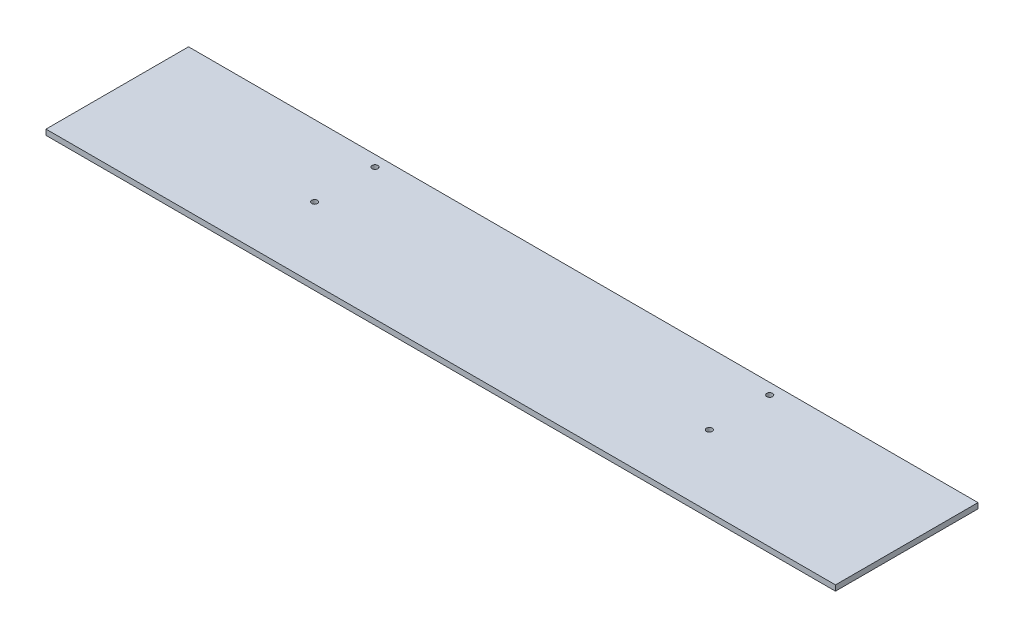
ISO-10303-21;
HEADER;
FILE_DESCRIPTION(('STEP AP214'),'2;1');
FILE_NAME('part.step','',(''),(''),'','','');
FILE_SCHEMA(('AUTOMOTIVE_DESIGN { 1 0 10303 214 1 1 1 1 }'));
ENDSEC;
DATA;
#1=APPLICATION_CONTEXT('core data for automotive mechanical design processes');
#2=APPLICATION_PROTOCOL_DEFINITION('international standard','automotive_design',2000,#1);
#3=PRODUCT_CONTEXT('',#1,'mechanical');
#4=PRODUCT('Part','Part','',(#3));
#5=PRODUCT_RELATED_PRODUCT_CATEGORY('part','',(#4));
#6=PRODUCT_DEFINITION_FORMATION('','',#4);
#7=PRODUCT_DEFINITION_CONTEXT('part definition',#1,'design');
#8=PRODUCT_DEFINITION('design','',#6,#7);
#9=PRODUCT_DEFINITION_SHAPE('','',#8);
#10=(LENGTH_UNIT() NAMED_UNIT(*) SI_UNIT(.MILLI.,.METRE.));
#11=(NAMED_UNIT(*) PLANE_ANGLE_UNIT() SI_UNIT($,.RADIAN.));
#12=(NAMED_UNIT(*) SI_UNIT($,.STERADIAN.) SOLID_ANGLE_UNIT());
#13=UNCERTAINTY_MEASURE_WITH_UNIT(LENGTH_MEASURE(1.E-05),#10,'distance_accuracy_value','');
#14=(GEOMETRIC_REPRESENTATION_CONTEXT(3) GLOBAL_UNCERTAINTY_ASSIGNED_CONTEXT((#13)) GLOBAL_UNIT_ASSIGNED_CONTEXT((#10,
#11,#12)) REPRESENTATION_CONTEXT('',''));
#15=CARTESIAN_POINT('',(0.,0.,0.));
#16=DIRECTION('',(0.,0.,1.));
#17=DIRECTION('',(1.,0.,0.));
#18=AXIS2_PLACEMENT_3D('',#15,#16,#17);
#19=CARTESIAN_POINT('',(457.2,-6.35,-665.126898193359));
#20=DIRECTION('',(0.,0.,1.));
#21=DIRECTION('',(1.,0.,0.));
#22=AXIS2_PLACEMENT_3D('',#19,#20,#21);
#23=PLANE('',#22);
#24=DIRECTION('',(1.,0.,0.));
#25=VECTOR('',#24,1.);
#26=CARTESIAN_POINT('',(457.2,0.,-665.126898193359));
#27=LINE('',#26,#25);
#28=CARTESIAN_POINT('',(0.,0.,-665.126898193359));
#29=VERTEX_POINT('',#28);
#30=CARTESIAN_POINT('',(914.4,0.,-665.126898193359));
#31=VERTEX_POINT('',#30);
#32=EDGE_CURVE('E102',#29,#31,#27,.T.);
#33=ORIENTED_EDGE('',*,*,#32,.F.);
#34=DIRECTION('',(0.,1.,0.));
#35=VECTOR('',#34,1.);
#36=CARTESIAN_POINT('',(0.,-6.35,-665.126898193359));
#37=LINE('',#36,#35);
#38=CARTESIAN_POINT('',(0.,-6.35,-665.126898193359));
#39=VERTEX_POINT('',#38);
#40=EDGE_CURVE('E9',#39,#29,#37,.T.);
#41=ORIENTED_EDGE('',*,*,#40,.F.);
#42=DIRECTION('',(1.,0.,0.));
#43=VECTOR('',#42,1.);
#44=CARTESIAN_POINT('',(457.2,-6.35,-665.126898193359));
#45=LINE('',#44,#43);
#46=CARTESIAN_POINT('',(914.4,-6.35,-665.126898193359));
#47=VERTEX_POINT('',#46);
#48=EDGE_CURVE('E79',#39,#47,#45,.T.);
#49=ORIENTED_EDGE('',*,*,#48,.T.);
#50=DIRECTION('',(0.,1.,0.));
#51=VECTOR('',#50,1.);
#52=CARTESIAN_POINT('',(914.4,-6.35,-665.126898193359));
#53=LINE('',#52,#51);
#54=EDGE_CURVE('E38',#47,#31,#53,.T.);
#55=ORIENTED_EDGE('',*,*,#54,.T.);
#56=EDGE_LOOP('',(#33,#41,#49,#55));
#57=FACE_BOUND('',#56,.T.);
#58=ADVANCED_FACE('F14',(#57),#23,.T.);
#59=CARTESIAN_POINT('',(0.,-6.35,-747.676898193359));
#60=DIRECTION('',(1.,0.,0.));
#61=DIRECTION('',(0.,0.,-1.));
#62=AXIS2_PLACEMENT_3D('',#59,#60,#61);
#63=PLANE('',#62);
#64=DIRECTION('',(0.,0.,-1.));
#65=VECTOR('',#64,1.);
#66=CARTESIAN_POINT('',(0.,0.,-747.676898193359));
#67=LINE('',#66,#65);
#68=CARTESIAN_POINT('',(0.,0.,-830.226898193359));
#69=VERTEX_POINT('',#68);
#70=EDGE_CURVE('E86',#29,#69,#67,.T.);
#71=ORIENTED_EDGE('',*,*,#70,.T.);
#72=DIRECTION('',(0.,1.,0.));
#73=VECTOR('',#72,1.);
#74=CARTESIAN_POINT('',(0.,-6.35,-830.226898193359));
#75=LINE('',#74,#73);
#76=CARTESIAN_POINT('',(0.,-6.35,-830.226898193359));
#77=VERTEX_POINT('',#76);
#78=EDGE_CURVE('E24',#77,#69,#75,.T.);
#79=ORIENTED_EDGE('',*,*,#78,.F.);
#80=DIRECTION('',(0.,0.,-1.));
#81=VECTOR('',#80,1.);
#82=CARTESIAN_POINT('',(0.,-6.35,-747.676898193359));
#83=LINE('',#82,#81);
#84=EDGE_CURVE('E73',#39,#77,#83,.T.);
#85=ORIENTED_EDGE('',*,*,#84,.F.);
#86=ORIENTED_EDGE('',*,*,#40,.T.);
#87=EDGE_LOOP('',(#71,#79,#85,#86));
#88=FACE_BOUND('',#87,.T.);
#89=ADVANCED_FACE('F84',(#88),#63,.F.);
#90=CARTESIAN_POINT('',(457.2,-6.35,-830.226898193359));
#91=DIRECTION('',(0.,0.,1.));
#92=DIRECTION('',(1.,0.,0.));
#93=AXIS2_PLACEMENT_3D('',#90,#91,#92);
#94=PLANE('',#93);
#95=DIRECTION('',(1.,0.,0.));
#96=VECTOR('',#95,1.);
#97=CARTESIAN_POINT('',(457.2,0.,-830.226898193359));
#98=LINE('',#97,#96);
#99=CARTESIAN_POINT('',(914.4,0.,-830.226898193359));
#100=VERTEX_POINT('',#99);
#101=EDGE_CURVE('E107',#69,#100,#98,.T.);
#102=ORIENTED_EDGE('',*,*,#101,.T.);
#103=DIRECTION('',(0.,1.,0.));
#104=VECTOR('',#103,1.);
#105=CARTESIAN_POINT('',(914.4,-6.35,-830.226898193359));
#106=LINE('',#105,#104);
#107=CARTESIAN_POINT('',(914.4,-6.35,-830.226898193359));
#108=VERTEX_POINT('',#107);
#109=EDGE_CURVE('E57',#108,#100,#106,.T.);
#110=ORIENTED_EDGE('',*,*,#109,.F.);
#111=DIRECTION('',(1.,0.,0.));
#112=VECTOR('',#111,1.);
#113=CARTESIAN_POINT('',(457.2,-6.35,-830.226898193359));
#114=LINE('',#113,#112);
#115=EDGE_CURVE('E78',#77,#108,#114,.T.);
#116=ORIENTED_EDGE('',*,*,#115,.F.);
#117=ORIENTED_EDGE('',*,*,#78,.T.);
#118=EDGE_LOOP('',(#102,#110,#116,#117));
#119=FACE_BOUND('',#118,.T.);
#120=ADVANCED_FACE('F91',(#119),#94,.F.);
#121=CARTESIAN_POINT('',(914.4,-6.35,-747.676898193359));
#122=DIRECTION('',(1.,0.,0.));
#123=DIRECTION('',(0.,0.,-1.));
#124=AXIS2_PLACEMENT_3D('',#121,#122,#123);
#125=PLANE('',#124);
#126=DIRECTION('',(0.,0.,-1.));
#127=VECTOR('',#126,1.);
#128=CARTESIAN_POINT('',(914.4,0.,-747.676898193359));
#129=LINE('',#128,#127);
#130=EDGE_CURVE('E109',#31,#100,#129,.T.);
#131=ORIENTED_EDGE('',*,*,#130,.F.);
#132=ORIENTED_EDGE('',*,*,#54,.F.);
#133=DIRECTION('',(0.,0.,-1.));
#134=VECTOR('',#133,1.);
#135=CARTESIAN_POINT('',(914.4,-6.35,-747.676898193359));
#136=LINE('',#135,#134);
#137=EDGE_CURVE('E93',#47,#108,#136,.T.);
#138=ORIENTED_EDGE('',*,*,#137,.T.);
#139=ORIENTED_EDGE('',*,*,#109,.T.);
#140=EDGE_LOOP('',(#131,#132,#138,#139));
#141=FACE_BOUND('',#140,.T.);
#142=ADVANCED_FACE('F152',(#141),#125,.T.);
#143=CARTESIAN_POINT('',(457.2,-6.35,-747.676898193359));
#144=DIRECTION('',(0.,-1.,0.));
#145=DIRECTION('',(1.,0.,0.));
#146=AXIS2_PLACEMENT_3D('',#143,#144,#145);
#147=PLANE('',#146);
#148=CARTESIAN_POINT('',(685.8,-6.35,-747.676898193359));
#149=DIRECTION('',(0.,-1.,0.));
#150=DIRECTION('',(0.,0.,-1.));
#151=AXIS2_PLACEMENT_3D('',#148,#149,#150);
#152=CIRCLE('',#151,3.3655);
#153=CARTESIAN_POINT('',(685.8,-6.35,-751.042398193359));
#154=VERTEX_POINT('',#153);
#155=EDGE_CURVE('E145',#154,#154,#152,.T.);
#156=ORIENTED_EDGE('',*,*,#155,.F.);
#157=EDGE_LOOP('',(#156));
#158=FACE_BOUND('',#157,.T.);
#159=CARTESIAN_POINT('',(685.8,-6.35,-817.526898193359));
#160=DIRECTION('',(0.,-1.,0.));
#161=DIRECTION('',(0.,0.,-1.));
#162=AXIS2_PLACEMENT_3D('',#159,#160,#161);
#163=CIRCLE('',#162,3.3655);
#164=CARTESIAN_POINT('',(685.8,-6.35,-820.892398193359));
#165=VERTEX_POINT('',#164);
#166=EDGE_CURVE('E128',#165,#165,#163,.T.);
#167=ORIENTED_EDGE('',*,*,#166,.F.);
#168=EDGE_LOOP('',(#167));
#169=FACE_BOUND('',#168,.T.);
#170=CARTESIAN_POINT('',(228.6,-6.35,-817.526898193359));
#171=DIRECTION('',(0.,-1.,0.));
#172=DIRECTION('',(0.,0.,-1.));
#173=AXIS2_PLACEMENT_3D('',#170,#171,#172);
#174=CIRCLE('',#173,3.3655);
#175=CARTESIAN_POINT('',(228.6,-6.35,-820.892398193359));
#176=VERTEX_POINT('',#175);
#177=EDGE_CURVE('E124',#176,#176,#174,.T.);
#178=ORIENTED_EDGE('',*,*,#177,.F.);
#179=EDGE_LOOP('',(#178));
#180=FACE_BOUND('',#179,.T.);
#181=CARTESIAN_POINT('',(228.6,-6.35,-747.676898193359));
#182=DIRECTION('',(0.,-1.,0.));
#183=DIRECTION('',(0.,0.,-1.));
#184=AXIS2_PLACEMENT_3D('',#181,#182,#183);
#185=CIRCLE('',#184,3.3655);
#186=CARTESIAN_POINT('',(228.6,-6.35,-751.042398193359));
#187=VERTEX_POINT('',#186);
#188=EDGE_CURVE('E120',#187,#187,#185,.T.);
#189=ORIENTED_EDGE('',*,*,#188,.F.);
#190=EDGE_LOOP('',(#189));
#191=FACE_BOUND('',#190,.T.);
#192=ORIENTED_EDGE('',*,*,#48,.F.);
#193=ORIENTED_EDGE('',*,*,#84,.T.);
#194=ORIENTED_EDGE('',*,*,#115,.T.);
#195=ORIENTED_EDGE('',*,*,#137,.F.);
#196=EDGE_LOOP('',(#192,#193,#194,#195));
#197=FACE_BOUND('',#196,.T.);
#198=ADVANCED_FACE('F75',(#158,#169,#180,#191,#197),#147,.T.);
#199=CARTESIAN_POINT('',(457.2,0.,-747.676898193359));
#200=DIRECTION('',(0.,-1.,0.));
#201=DIRECTION('',(1.,0.,0.));
#202=AXIS2_PLACEMENT_3D('',#199,#200,#201);
#203=PLANE('',#202);
#204=CARTESIAN_POINT('',(685.8,0.,-747.676898193359));
#205=DIRECTION('',(0.,-1.,0.));
#206=DIRECTION('',(0.,0.,-1.));
#207=AXIS2_PLACEMENT_3D('',#204,#205,#206);
#208=CIRCLE('',#207,3.3655);
#209=CARTESIAN_POINT('',(685.8,0.,-751.042398193359));
#210=VERTEX_POINT('',#209);
#211=EDGE_CURVE('E17',#210,#210,#208,.F.);
#212=ORIENTED_EDGE('',*,*,#211,.F.);
#213=EDGE_LOOP('',(#212));
#214=FACE_BOUND('',#213,.T.);
#215=CARTESIAN_POINT('',(685.8,0.,-817.526898193359));
#216=DIRECTION('',(0.,-1.,0.));
#217=DIRECTION('',(0.,0.,-1.));
#218=AXIS2_PLACEMENT_3D('',#215,#216,#217);
#219=CIRCLE('',#218,3.3655);
#220=CARTESIAN_POINT('',(685.8,0.,-820.892398193359));
#221=VERTEX_POINT('',#220);
#222=EDGE_CURVE('E125',#221,#221,#219,.F.);
#223=ORIENTED_EDGE('',*,*,#222,.F.);
#224=EDGE_LOOP('',(#223));
#225=FACE_BOUND('',#224,.T.);
#226=CARTESIAN_POINT('',(228.6,0.,-817.526898193359));
#227=DIRECTION('',(0.,-1.,0.));
#228=DIRECTION('',(0.,0.,-1.));
#229=AXIS2_PLACEMENT_3D('',#226,#227,#228);
#230=CIRCLE('',#229,3.3655);
#231=CARTESIAN_POINT('',(228.6,0.,-820.892398193359));
#232=VERTEX_POINT('',#231);
#233=EDGE_CURVE('E121',#232,#232,#230,.F.);
#234=ORIENTED_EDGE('',*,*,#233,.F.);
#235=EDGE_LOOP('',(#234));
#236=FACE_BOUND('',#235,.T.);
#237=CARTESIAN_POINT('',(228.6,0.,-747.676898193359));
#238=DIRECTION('',(0.,-1.,0.));
#239=DIRECTION('',(0.,0.,-1.));
#240=AXIS2_PLACEMENT_3D('',#237,#238,#239);
#241=CIRCLE('',#240,3.3655);
#242=CARTESIAN_POINT('',(228.6,0.,-751.042398193359));
#243=VERTEX_POINT('',#242);
#244=EDGE_CURVE('E105',#243,#243,#241,.F.);
#245=ORIENTED_EDGE('',*,*,#244,.F.);
#246=EDGE_LOOP('',(#245));
#247=FACE_BOUND('',#246,.T.);
#248=ORIENTED_EDGE('',*,*,#32,.T.);
#249=ORIENTED_EDGE('',*,*,#130,.T.);
#250=ORIENTED_EDGE('',*,*,#101,.F.);
#251=ORIENTED_EDGE('',*,*,#70,.F.);
#252=EDGE_LOOP('',(#248,#249,#250,#251));
#253=FACE_BOUND('',#252,.T.);
#254=ADVANCED_FACE('F160',(#214,#225,#236,#247,#253),#203,.F.);
#255=CARTESIAN_POINT('',(228.6,923.868121694976,-747.676898193359));
#256=DIRECTION('',(0.,-1.,0.));
#257=DIRECTION('',(0.,0.,-1.));
#258=AXIS2_PLACEMENT_3D('',#255,#256,#257);
#259=CYLINDRICAL_SURFACE('',#258,3.3655);
#260=ORIENTED_EDGE('',*,*,#188,.T.);
#261=EDGE_LOOP('',(#260));
#262=FACE_BOUND('',#261,.T.);
#263=ORIENTED_EDGE('',*,*,#244,.T.);
#264=EDGE_LOOP('',(#263));
#265=FACE_BOUND('',#264,.T.);
#266=ADVANCED_FACE('F202',(#262,#265),#259,.F.);
#267=CARTESIAN_POINT('',(228.6,923.868121694976,-817.526898193359));
#268=DIRECTION('',(0.,-1.,0.));
#269=DIRECTION('',(0.,0.,-1.));
#270=AXIS2_PLACEMENT_3D('',#267,#268,#269);
#271=CYLINDRICAL_SURFACE('',#270,3.3655);
#272=ORIENTED_EDGE('',*,*,#177,.T.);
#273=EDGE_LOOP('',(#272));
#274=FACE_BOUND('',#273,.T.);
#275=ORIENTED_EDGE('',*,*,#233,.T.);
#276=EDGE_LOOP('',(#275));
#277=FACE_BOUND('',#276,.T.);
#278=ADVANCED_FACE('F212',(#274,#277),#271,.F.);
#279=CARTESIAN_POINT('',(685.8,923.868121694976,-817.526898193359));
#280=DIRECTION('',(0.,-1.,0.));
#281=DIRECTION('',(0.,0.,-1.));
#282=AXIS2_PLACEMENT_3D('',#279,#280,#281);
#283=CYLINDRICAL_SURFACE('',#282,3.3655);
#284=ORIENTED_EDGE('',*,*,#166,.T.);
#285=EDGE_LOOP('',(#284));
#286=FACE_BOUND('',#285,.T.);
#287=ORIENTED_EDGE('',*,*,#222,.T.);
#288=EDGE_LOOP('',(#287));
#289=FACE_BOUND('',#288,.T.);
#290=ADVANCED_FACE('F223',(#286,#289),#283,.F.);
#291=CARTESIAN_POINT('',(685.8,923.868121694976,-747.676898193359));
#292=DIRECTION('',(0.,-1.,0.));
#293=DIRECTION('',(0.,0.,-1.));
#294=AXIS2_PLACEMENT_3D('',#291,#292,#293);
#295=CYLINDRICAL_SURFACE('',#294,3.3655);
#296=ORIENTED_EDGE('',*,*,#155,.T.);
#297=EDGE_LOOP('',(#296));
#298=FACE_BOUND('',#297,.T.);
#299=ORIENTED_EDGE('',*,*,#211,.T.);
#300=EDGE_LOOP('',(#299));
#301=FACE_BOUND('',#300,.T.);
#302=ADVANCED_FACE('F233',(#298,#301),#295,.F.);
#303=CLOSED_SHELL('',(#58,#89,#120,#142,#198,#254,#266,#278,#290,#302));
#304=MANIFOLD_SOLID_BREP('B1',#303);
#305=ADVANCED_BREP_SHAPE_REPRESENTATION('',(#18,#304),#14);
#306=SHAPE_DEFINITION_REPRESENTATION(#9,#305);
ENDSEC;
END-ISO-10303-21;
